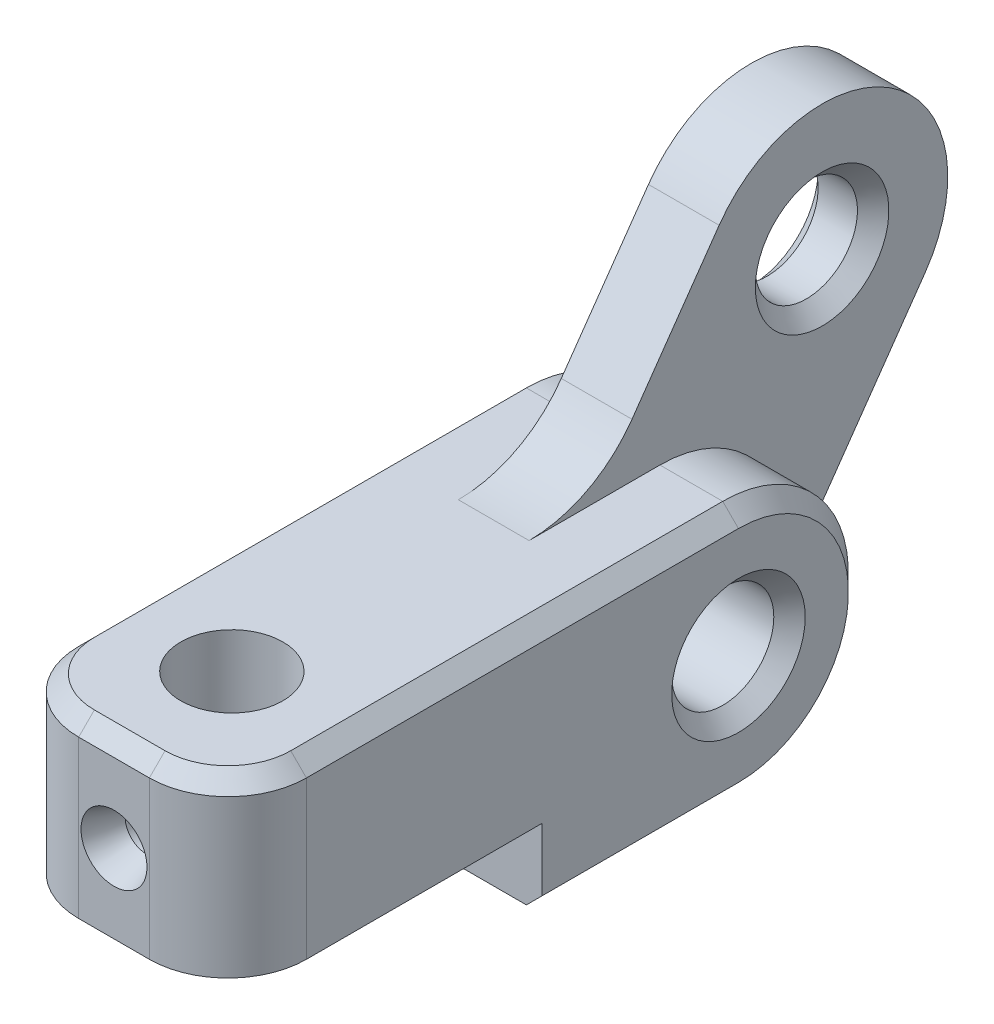
ISO-10303-21;
HEADER;
FILE_DESCRIPTION(('STEP AP214'),'2;1');
FILE_NAME('part.step','',(''),(''),'','','');
FILE_SCHEMA(('AUTOMOTIVE_DESIGN { 1 0 10303 214 1 1 1 1 }'));
ENDSEC;
DATA;
#1=APPLICATION_CONTEXT('core data for automotive mechanical design processes');
#2=APPLICATION_PROTOCOL_DEFINITION('international standard','automotive_design',2000,#1);
#3=PRODUCT_CONTEXT('',#1,'mechanical');
#4=PRODUCT('Part','Part','',(#3));
#5=PRODUCT_RELATED_PRODUCT_CATEGORY('part','',(#4));
#6=PRODUCT_DEFINITION_FORMATION('','',#4);
#7=PRODUCT_DEFINITION_CONTEXT('part definition',#1,'design');
#8=PRODUCT_DEFINITION('design','',#6,#7);
#9=PRODUCT_DEFINITION_SHAPE('','',#8);
#10=(LENGTH_UNIT() NAMED_UNIT(*) SI_UNIT(.MILLI.,.METRE.));
#11=(NAMED_UNIT(*) PLANE_ANGLE_UNIT() SI_UNIT($,.RADIAN.));
#12=(NAMED_UNIT(*) SI_UNIT($,.STERADIAN.) SOLID_ANGLE_UNIT());
#13=UNCERTAINTY_MEASURE_WITH_UNIT(LENGTH_MEASURE(1.E-05),#10,'distance_accuracy_value','');
#14=(GEOMETRIC_REPRESENTATION_CONTEXT(3) GLOBAL_UNCERTAINTY_ASSIGNED_CONTEXT((#13)) GLOBAL_UNIT_ASSIGNED_CONTEXT((#10,
#11,#12)) REPRESENTATION_CONTEXT('',''));
#15=CARTESIAN_POINT('',(0.,0.,0.));
#16=DIRECTION('',(0.,0.,1.));
#17=DIRECTION('',(1.,0.,0.));
#18=AXIS2_PLACEMENT_3D('',#15,#16,#17);
#19=CARTESIAN_POINT('',(-2.25,14.7447367972018,-10.3243758543189));
#20=DIRECTION('',(-1.,0.,0.));
#21=DIRECTION('',(0.,0.,1.));
#22=AXIS2_PLACEMENT_3D('',#19,#20,#21);
#23=PLANE('',#22);
#24=CARTESIAN_POINT('',(-2.25,14.7447367972018,-10.3243758543189));
#25=DIRECTION('',(-1.,0.,0.));
#26=DIRECTION('',(0.,0.,1.));
#27=AXIS2_PLACEMENT_3D('',#24,#25,#26);
#28=CIRCLE('',#27,4.25000000000001);
#29=CARTESIAN_POINT('',(-2.25,14.7447367972018,-6.07437585431889));
#30=VERTEX_POINT('',#29);
#31=EDGE_CURVE('E391',#30,#30,#28,.F.);
#32=ORIENTED_EDGE('',*,*,#31,.T.);
#33=EDGE_LOOP('',(#32));
#34=FACE_BOUND('',#33,.T.);
#35=DIRECTION('',(0.,0.819152044288989,-0.57357643635105));
#36=VECTOR('',#35,1.);
#37=CARTESIAN_POINT('',(-2.25,-4.58861149080837,-6.55321635431193));
#38=LINE('',#37,#36);
#39=CARTESIAN_POINT('',(-2.25,-4.5886114908084,-6.55321635431191));
#40=VERTEX_POINT('',#39);
#41=CARTESIAN_POINT('',(-2.25,10.1561253063934,-16.8775922086308));
#42=VERTEX_POINT('',#41);
#43=EDGE_CURVE('E252',#40,#42,#38,.T.);
#44=ORIENTED_EDGE('',*,*,#43,.F.);
#45=CARTESIAN_POINT('',(-2.25,0.,0.));
#46=DIRECTION('',(1.,0.,0.));
#47=DIRECTION('',(0.,0.,-1.));
#48=AXIS2_PLACEMENT_3D('',#45,#46,#47);
#49=CIRCLE('',#48,8.);
#50=CARTESIAN_POINT('',(-2.25,8.,0.));
#51=VERTEX_POINT('',#50);
#52=EDGE_CURVE('E222',#40,#51,#49,.T.);
#53=ORIENTED_EDGE('',*,*,#52,.T.);
#54=DIRECTION('',(0.,0.,1.));
#55=VECTOR('',#54,1.);
#56=CARTESIAN_POINT('',(-2.25,8.,32.5));
#57=LINE('',#56,#55);
#58=CARTESIAN_POINT('',(-2.25,8.,8.32907280882793));
#59=VERTEX_POINT('',#58);
#60=EDGE_CURVE('E214',#51,#59,#57,.T.);
#61=ORIENTED_EDGE('',*,*,#60,.T.);
#62=CARTESIAN_POINT('',(-2.25,16.,8.32907280882789));
#63=DIRECTION('',(-1.,0.,0.));
#64=DIRECTION('',(0.,0.,1.));
#65=AXIS2_PLACEMENT_3D('',#62,#63,#64);
#66=CIRCLE('',#65,8.);
#67=CARTESIAN_POINT('',(-2.25,11.4113885091916,1.77585645451596));
#68=VERTEX_POINT('',#67);
#69=EDGE_CURVE('E268',#68,#59,#66,.T.);
#70=ORIENTED_EDGE('',*,*,#69,.F.);
#71=DIRECTION('',(0.,-0.819152044288989,0.57357643635105));
#72=VECTOR('',#71,1.);
#73=CARTESIAN_POINT('',(-2.25,11.4113885091916,1.77585645451596));
#74=LINE('',#73,#72);
#75=CARTESIAN_POINT('',(-2.25,19.3333482880102,-3.77115950000699));
#76=VERTEX_POINT('',#75);
#77=EDGE_CURVE('E265',#76,#68,#74,.T.);
#78=ORIENTED_EDGE('',*,*,#77,.F.);
#79=CARTESIAN_POINT('',(-2.25,14.7447367972018,-10.3243758543189));
#80=DIRECTION('',(1.,0.,0.));
#81=DIRECTION('',(0.,0.,1.));
#82=AXIS2_PLACEMENT_3D('',#79,#80,#81);
#83=CIRCLE('',#82,8.);
#84=EDGE_CURVE('E246',#42,#76,#83,.T.);
#85=ORIENTED_EDGE('',*,*,#84,.F.);
#86=EDGE_LOOP('',(#44,#53,#61,#70,#78,#85));
#87=FACE_BOUND('',#86,.T.);
#88=ADVANCED_FACE('F48',(#34,#87),#23,.T.);
#89=CARTESIAN_POINT('',(2.25,14.7447367972018,-10.3243758543189));
#90=DIRECTION('',(-1.,0.,0.));
#91=DIRECTION('',(0.,0.,1.));
#92=AXIS2_PLACEMENT_3D('',#89,#90,#91);
#93=PLANE('',#92);
#94=CARTESIAN_POINT('',(2.25,14.7447367972018,-10.3243758543189));
#95=DIRECTION('',(-1.,0.,0.));
#96=DIRECTION('',(0.,0.,1.));
#97=AXIS2_PLACEMENT_3D('',#94,#95,#96);
#98=CIRCLE('',#97,4.25000000000002);
#99=CARTESIAN_POINT('',(2.25,14.7447367972018,-6.07437585431888));
#100=VERTEX_POINT('',#99);
#101=EDGE_CURVE('E403',#100,#100,#98,.T.);
#102=ORIENTED_EDGE('',*,*,#101,.T.);
#103=EDGE_LOOP('',(#102));
#104=FACE_BOUND('',#103,.T.);
#105=DIRECTION('',(0.,0.,1.));
#106=VECTOR('',#105,1.);
#107=CARTESIAN_POINT('',(2.25,8.,32.5));
#108=LINE('',#107,#106);
#109=CARTESIAN_POINT('',(2.25,8.,0.));
#110=VERTEX_POINT('',#109);
#111=CARTESIAN_POINT('',(2.25,8.,8.32907280882793));
#112=VERTEX_POINT('',#111);
#113=EDGE_CURVE('E230',#110,#112,#108,.T.);
#114=ORIENTED_EDGE('',*,*,#113,.F.);
#115=CARTESIAN_POINT('',(2.25,0.,0.));
#116=DIRECTION('',(1.,0.,0.));
#117=DIRECTION('',(0.,0.,-1.));
#118=AXIS2_PLACEMENT_3D('',#115,#116,#117);
#119=CIRCLE('',#118,8.);
#120=CARTESIAN_POINT('',(2.25,-4.58861149080837,-6.55321635431193));
#121=VERTEX_POINT('',#120);
#122=EDGE_CURVE('E227',#121,#110,#119,.T.);
#123=ORIENTED_EDGE('',*,*,#122,.F.);
#124=DIRECTION('',(0.,0.819152044288989,-0.57357643635105));
#125=VECTOR('',#124,1.);
#126=CARTESIAN_POINT('',(2.25,-4.58861149080837,-6.55321635431193));
#127=LINE('',#126,#125);
#128=CARTESIAN_POINT('',(2.25,10.1561253063934,-16.8775922086308));
#129=VERTEX_POINT('',#128);
#130=EDGE_CURVE('E258',#121,#129,#127,.T.);
#131=ORIENTED_EDGE('',*,*,#130,.T.);
#132=CARTESIAN_POINT('',(2.25,14.7447367972018,-10.3243758543189));
#133=DIRECTION('',(1.,0.,0.));
#134=DIRECTION('',(0.,0.,1.));
#135=AXIS2_PLACEMENT_3D('',#132,#133,#134);
#136=CIRCLE('',#135,8.);
#137=CARTESIAN_POINT('',(2.25,19.3333482880102,-3.77115950000699));
#138=VERTEX_POINT('',#137);
#139=EDGE_CURVE('E247',#129,#138,#136,.T.);
#140=ORIENTED_EDGE('',*,*,#139,.T.);
#141=DIRECTION('',(0.,-0.819152044288989,0.57357643635105));
#142=VECTOR('',#141,1.);
#143=CARTESIAN_POINT('',(2.25,11.4113885091916,1.77585645451596));
#144=LINE('',#143,#142);
#145=CARTESIAN_POINT('',(2.25,11.4113885091916,1.77585645451596));
#146=VERTEX_POINT('',#145);
#147=EDGE_CURVE('E251',#138,#146,#144,.T.);
#148=ORIENTED_EDGE('',*,*,#147,.T.);
#149=CARTESIAN_POINT('',(2.25,16.,8.32907280882789));
#150=DIRECTION('',(-1.,0.,0.));
#151=DIRECTION('',(0.,0.,1.));
#152=AXIS2_PLACEMENT_3D('',#149,#150,#151);
#153=CIRCLE('',#152,8.);
#154=EDGE_CURVE('E255',#146,#112,#153,.T.);
#155=ORIENTED_EDGE('',*,*,#154,.T.);
#156=EDGE_LOOP('',(#114,#123,#131,#140,#148,#155));
#157=FACE_BOUND('',#156,.T.);
#158=ADVANCED_FACE('F463',(#104,#157),#93,.F.);
#159=CARTESIAN_POINT('',(2.25,14.7447367972018,-10.3243758543189));
#160=DIRECTION('',(-1.,0.,0.));
#161=DIRECTION('',(0.,0.,1.));
#162=AXIS2_PLACEMENT_3D('',#159,#160,#161);
#163=CYLINDRICAL_SURFACE('',#162,8.);
#164=ORIENTED_EDGE('',*,*,#84,.T.);
#165=DIRECTION('',(-1.,0.,0.));
#166=VECTOR('',#165,1.);
#167=CARTESIAN_POINT('',(2.25,19.3333482880102,-3.77115950000699));
#168=LINE('',#167,#166);
#169=EDGE_CURVE('E240',#138,#76,#168,.T.);
#170=ORIENTED_EDGE('',*,*,#169,.F.);
#171=ORIENTED_EDGE('',*,*,#139,.F.);
#172=DIRECTION('',(-1.,0.,0.));
#173=VECTOR('',#172,1.);
#174=CARTESIAN_POINT('',(2.25,10.1561253063934,-16.8775922086308));
#175=LINE('',#174,#173);
#176=EDGE_CURVE('E261',#129,#42,#175,.T.);
#177=ORIENTED_EDGE('',*,*,#176,.T.);
#178=EDGE_LOOP('',(#164,#170,#171,#177));
#179=FACE_BOUND('',#178,.T.);
#180=ADVANCED_FACE('F470',(#179),#163,.T.);
#181=CARTESIAN_POINT('',(2.25,11.4113885091916,1.77585645451596));
#182=DIRECTION('',(0.,-0.57357643635105,-0.819152044288989));
#183=DIRECTION('',(0.,0.819152044288989,-0.57357643635105));
#184=AXIS2_PLACEMENT_3D('',#181,#182,#183);
#185=PLANE('',#184);
#186=ORIENTED_EDGE('',*,*,#77,.T.);
#187=DIRECTION('',(-1.,0.,0.));
#188=VECTOR('',#187,1.);
#189=CARTESIAN_POINT('',(2.25,11.4113885091916,1.77585645451596));
#190=LINE('',#189,#188);
#191=EDGE_CURVE('E294',#146,#68,#190,.T.);
#192=ORIENTED_EDGE('',*,*,#191,.F.);
#193=ORIENTED_EDGE('',*,*,#147,.F.);
#194=ORIENTED_EDGE('',*,*,#169,.T.);
#195=EDGE_LOOP('',(#186,#192,#193,#194));
#196=FACE_BOUND('',#195,.T.);
#197=ADVANCED_FACE('F505',(#196),#185,.F.);
#198=CARTESIAN_POINT('',(2.25,16.,8.32907280882789));
#199=DIRECTION('',(-1.,0.,0.));
#200=DIRECTION('',(0.,0.,1.));
#201=AXIS2_PLACEMENT_3D('',#198,#199,#200);
#202=CYLINDRICAL_SURFACE('',#201,8.);
#203=ORIENTED_EDGE('',*,*,#69,.T.);
#204=DIRECTION('',(-1.,0.,0.));
#205=VECTOR('',#204,1.);
#206=CARTESIAN_POINT('',(2.25,8.,8.32907280882793));
#207=LINE('',#206,#205);
#208=EDGE_CURVE('E290',#112,#59,#207,.T.);
#209=ORIENTED_EDGE('',*,*,#208,.F.);
#210=ORIENTED_EDGE('',*,*,#154,.F.);
#211=ORIENTED_EDGE('',*,*,#191,.T.);
#212=EDGE_LOOP('',(#203,#209,#210,#211));
#213=FACE_BOUND('',#212,.T.);
#214=ADVANCED_FACE('F501',(#213),#202,.F.);
#215=CARTESIAN_POINT('',(2.25,8.,25.));
#216=DIRECTION('',(0.,-1.,0.));
#217=DIRECTION('',(0.,0.,-1.));
#218=AXIS2_PLACEMENT_3D('',#215,#216,#217);
#219=PLANE('',#218);
#220=CARTESIAN_POINT('',(0.,8.,25.));
#221=DIRECTION('',(0.,-1.,0.));
#222=DIRECTION('',(0.,0.,-1.));
#223=AXIS2_PLACEMENT_3D('',#220,#221,#222);
#224=CIRCLE('',#223,3.25);
#225=CARTESIAN_POINT('',(0.,8.,21.75));
#226=VERTEX_POINT('',#225);
#227=EDGE_CURVE('E217',#226,#226,#224,.T.);
#228=ORIENTED_EDGE('',*,*,#227,.T.);
#229=EDGE_LOOP('',(#228));
#230=FACE_BOUND('',#229,.T.);
#231=DIRECTION('',(1.,0.,0.));
#232=VECTOR('',#231,1.);
#233=CARTESIAN_POINT('',(-7.25,8.,0.));
#234=LINE('',#233,#232);
#235=CARTESIAN_POINT('',(-6.24999999999999,8.,0.));
#236=VERTEX_POINT('',#235);
#237=EDGE_CURVE('E197',#236,#51,#234,.T.);
#238=ORIENTED_EDGE('',*,*,#237,.F.);
#239=DIRECTION('',(0.,0.,1.));
#240=VECTOR('',#239,1.);
#241=CARTESIAN_POINT('',(-6.24999999999999,8.,27.5));
#242=LINE('',#241,#240);
#243=CARTESIAN_POINT('',(-6.24999999999999,8.,27.5));
#244=VERTEX_POINT('',#243);
#245=EDGE_CURVE('E381',#236,#244,#242,.T.);
#246=ORIENTED_EDGE('',*,*,#245,.T.);
#247=CARTESIAN_POINT('',(-2.25,8.,27.5));
#248=DIRECTION('',(0.,-1.,0.));
#249=DIRECTION('',(0.,0.,-1.));
#250=AXIS2_PLACEMENT_3D('',#247,#248,#249);
#251=CIRCLE('',#250,3.99999999999999);
#252=CARTESIAN_POINT('',(-2.25,8.,31.5));
#253=VERTEX_POINT('',#252);
#254=EDGE_CURVE('E378',#244,#253,#251,.F.);
#255=ORIENTED_EDGE('',*,*,#254,.T.);
#256=DIRECTION('',(1.,0.,0.));
#257=VECTOR('',#256,1.);
#258=CARTESIAN_POINT('',(2.25,8.,31.5));
#259=LINE('',#258,#257);
#260=CARTESIAN_POINT('',(2.25,8.,31.5));
#261=VERTEX_POINT('',#260);
#262=EDGE_CURVE('E375',#253,#261,#259,.T.);
#263=ORIENTED_EDGE('',*,*,#262,.T.);
#264=CARTESIAN_POINT('',(2.25,8.,27.5));
#265=DIRECTION('',(0.,-1.,0.));
#266=DIRECTION('',(0.,0.,-1.));
#267=AXIS2_PLACEMENT_3D('',#264,#265,#266);
#268=CIRCLE('',#267,3.99999999999999);
#269=CARTESIAN_POINT('',(6.24999999999999,8.,27.5));
#270=VERTEX_POINT('',#269);
#271=EDGE_CURVE('E372',#261,#270,#268,.F.);
#272=ORIENTED_EDGE('',*,*,#271,.T.);
#273=DIRECTION('',(0.,0.,-1.));
#274=VECTOR('',#273,1.);
#275=CARTESIAN_POINT('',(6.24999999999999,8.00000000000001,0.));
#276=LINE('',#275,#274);
#277=CARTESIAN_POINT('',(6.24999999999999,8.,0.));
#278=VERTEX_POINT('',#277);
#279=EDGE_CURVE('E369',#270,#278,#276,.T.);
#280=ORIENTED_EDGE('',*,*,#279,.T.);
#281=DIRECTION('',(-1.,0.,0.));
#282=VECTOR('',#281,1.);
#283=CARTESIAN_POINT('',(7.25,8.,0.));
#284=LINE('',#283,#282);
#285=EDGE_CURVE('E236',#278,#110,#284,.T.);
#286=ORIENTED_EDGE('',*,*,#285,.T.);
#287=ORIENTED_EDGE('',*,*,#113,.T.);
#288=ORIENTED_EDGE('',*,*,#208,.T.);
#289=ORIENTED_EDGE('',*,*,#60,.F.);
#290=EDGE_LOOP('',(#238,#246,#255,#263,#272,#280,#286,#287,#288,#289));
#291=FACE_BOUND('',#290,.T.);
#292=ADVANCED_FACE('F497',(#230,#291),#219,.F.);
#293=CARTESIAN_POINT('',(2.25,8.,32.5));
#294=DIRECTION('',(0.,0.,-1.));
#295=DIRECTION('',(-1.,0.,0.));
#296=AXIS2_PLACEMENT_3D('',#293,#294,#295);
#297=PLANE('',#296);
#298=CARTESIAN_POINT('',(0.,2.,32.5));
#299=DIRECTION('',(0.,0.,-1.));
#300=DIRECTION('',(-1.,0.,0.));
#301=AXIS2_PLACEMENT_3D('',#298,#299,#300);
#302=CIRCLE('',#301,2.10000000000007);
#303=CARTESIAN_POINT('',(-2.10000000000007,2.,32.5));
#304=VERTEX_POINT('',#303);
#305=EDGE_CURVE('E443',#304,#304,#302,.T.);
#306=ORIENTED_EDGE('',*,*,#305,.T.);
#307=EDGE_LOOP('',(#306));
#308=FACE_BOUND('',#307,.T.);
#309=DIRECTION('',(0.,-1.,0.));
#310=VECTOR('',#309,1.);
#311=CARTESIAN_POINT('',(2.25,8.,32.5));
#312=LINE('',#311,#310);
#313=CARTESIAN_POINT('',(2.25,-3.,32.5));
#314=VERTEX_POINT('',#313);
#315=CARTESIAN_POINT('',(2.25,6.99999999999999,32.5));
#316=VERTEX_POINT('',#315);
#317=EDGE_CURVE('E226',#314,#316,#312,.F.);
#318=ORIENTED_EDGE('',*,*,#317,.T.);
#319=DIRECTION('',(-1.,0.,0.));
#320=VECTOR('',#319,1.);
#321=CARTESIAN_POINT('',(2.25,6.99999999999999,32.5));
#322=LINE('',#321,#320);
#323=CARTESIAN_POINT('',(-2.25,6.99999999999999,32.5));
#324=VERTEX_POINT('',#323);
#325=EDGE_CURVE('E72',#316,#324,#322,.T.);
#326=ORIENTED_EDGE('',*,*,#325,.T.);
#327=DIRECTION('',(0.,-1.,0.));
#328=VECTOR('',#327,1.);
#329=CARTESIAN_POINT('',(-2.25,-3.,32.5));
#330=LINE('',#329,#328);
#331=CARTESIAN_POINT('',(-2.25,-3.,32.5));
#332=VERTEX_POINT('',#331);
#333=EDGE_CURVE('E303',#324,#332,#330,.T.);
#334=ORIENTED_EDGE('',*,*,#333,.T.);
#335=DIRECTION('',(-1.,0.,0.));
#336=VECTOR('',#335,1.);
#337=CARTESIAN_POINT('',(2.25,-3.,32.5));
#338=LINE('',#337,#336);
#339=EDGE_CURVE('E207',#314,#332,#338,.T.);
#340=ORIENTED_EDGE('',*,*,#339,.F.);
#341=EDGE_LOOP('',(#318,#326,#334,#340));
#342=FACE_BOUND('',#341,.T.);
#343=ADVANCED_FACE('F493',(#308,#342),#297,.F.);
#344=CARTESIAN_POINT('',(2.25,-3.,32.5));
#345=DIRECTION('',(0.,1.,0.));
#346=DIRECTION('',(0.,0.,1.));
#347=AXIS2_PLACEMENT_3D('',#344,#345,#346);
#348=PLANE('',#347);
#349=CARTESIAN_POINT('',(0.,-3.,25.));
#350=DIRECTION('',(0.,1.,0.));
#351=DIRECTION('',(0.,0.,1.));
#352=AXIS2_PLACEMENT_3D('',#349,#350,#351);
#353=CIRCLE('',#352,4.25000000000002);
#354=CARTESIAN_POINT('',(0.,-3.,29.25));
#355=VERTEX_POINT('',#354);
#356=EDGE_CURVE('E11',#355,#355,#353,.T.);
#357=ORIENTED_EDGE('',*,*,#356,.T.);
#358=EDGE_LOOP('',(#357));
#359=FACE_BOUND('',#358,.T.);
#360=ORIENTED_EDGE('',*,*,#339,.T.);
#361=CARTESIAN_POINT('',(-2.25,-3.,27.5));
#362=DIRECTION('',(0.,1.,0.));
#363=DIRECTION('',(0.,0.,1.));
#364=AXIS2_PLACEMENT_3D('',#361,#362,#363);
#365=CIRCLE('',#364,5.);
#366=CARTESIAN_POINT('',(-7.25,-3.,27.5));
#367=VERTEX_POINT('',#366);
#368=EDGE_CURVE('E191',#332,#367,#365,.F.);
#369=ORIENTED_EDGE('',*,*,#368,.T.);
#370=DIRECTION('',(0.,0.,-1.));
#371=VECTOR('',#370,1.);
#372=CARTESIAN_POINT('',(-7.25,-3.,32.5));
#373=LINE('',#372,#371);
#374=CARTESIAN_POINT('',(-7.25,-3.,12.5));
#375=VERTEX_POINT('',#374);
#376=EDGE_CURVE('E183',#367,#375,#373,.T.);
#377=ORIENTED_EDGE('',*,*,#376,.T.);
#378=DIRECTION('',(-1.,0.,0.));
#379=VECTOR('',#378,1.);
#380=CARTESIAN_POINT('',(2.25,-3.,12.5));
#381=LINE('',#380,#379);
#382=CARTESIAN_POINT('',(7.25,-3.,12.5));
#383=VERTEX_POINT('',#382);
#384=EDGE_CURVE('E188',#383,#375,#381,.T.);
#385=ORIENTED_EDGE('',*,*,#384,.F.);
#386=DIRECTION('',(0.,0.,-1.));
#387=VECTOR('',#386,1.);
#388=CARTESIAN_POINT('',(7.25,-3.,32.5));
#389=LINE('',#388,#387);
#390=CARTESIAN_POINT('',(7.25,-3.,27.5));
#391=VERTEX_POINT('',#390);
#392=EDGE_CURVE('E231',#391,#383,#389,.T.);
#393=ORIENTED_EDGE('',*,*,#392,.F.);
#394=CARTESIAN_POINT('',(2.25,-3.,27.5));
#395=DIRECTION('',(0.,1.,0.));
#396=DIRECTION('',(0.,0.,1.));
#397=AXIS2_PLACEMENT_3D('',#394,#395,#396);
#398=CIRCLE('',#397,5.);
#399=EDGE_CURVE('E306',#391,#314,#398,.F.);
#400=ORIENTED_EDGE('',*,*,#399,.T.);
#401=EDGE_LOOP('',(#360,#369,#377,#385,#393,#400));
#402=FACE_BOUND('',#401,.T.);
#403=ADVANCED_FACE('F186',(#359,#402),#348,.F.);
#404=CARTESIAN_POINT('',(2.25,-3.,12.5));
#405=DIRECTION('',(0.,0.,-1.));
#406=DIRECTION('',(-1.,0.,0.));
#407=AXIS2_PLACEMENT_3D('',#404,#405,#406);
#408=PLANE('',#407);
#409=DIRECTION('',(0.,-1.,0.));
#410=VECTOR('',#409,1.);
#411=CARTESIAN_POINT('',(-7.25,-3.,12.5));
#412=LINE('',#411,#410);
#413=CARTESIAN_POINT('',(-7.25,-6.99999999999999,12.5));
#414=VERTEX_POINT('',#413);
#415=EDGE_CURVE('E198',#375,#414,#412,.T.);
#416=ORIENTED_EDGE('',*,*,#415,.T.);
#417=DIRECTION('',(0.707106781186548,-0.707106781186548,0.));
#418=VECTOR('',#417,1.);
#419=CARTESIAN_POINT('',(-6.24999999999999,-8.,12.5));
#420=LINE('',#419,#418);
#421=CARTESIAN_POINT('',(-6.24999999999999,-8.,12.5));
#422=VERTEX_POINT('',#421);
#423=EDGE_CURVE('E366',#414,#422,#420,.T.);
#424=ORIENTED_EDGE('',*,*,#423,.T.);
#425=DIRECTION('',(-1.,0.,0.));
#426=VECTOR('',#425,1.);
#427=CARTESIAN_POINT('',(2.25,-8.,12.5));
#428=LINE('',#427,#426);
#429=CARTESIAN_POINT('',(6.24999999999999,-8.,12.5));
#430=VERTEX_POINT('',#429);
#431=EDGE_CURVE('E208',#430,#422,#428,.T.);
#432=ORIENTED_EDGE('',*,*,#431,.F.);
#433=DIRECTION('',(0.707106781186548,0.707106781186548,0.));
#434=VECTOR('',#433,1.);
#435=CARTESIAN_POINT('',(7.25,-6.99999999999999,12.5));
#436=LINE('',#435,#434);
#437=CARTESIAN_POINT('',(7.25,-6.99999999999999,12.5));
#438=VERTEX_POINT('',#437);
#439=EDGE_CURVE('E363',#430,#438,#436,.T.);
#440=ORIENTED_EDGE('',*,*,#439,.T.);
#441=DIRECTION('',(0.,-1.,0.));
#442=VECTOR('',#441,1.);
#443=CARTESIAN_POINT('',(7.25,-3.,12.5));
#444=LINE('',#443,#442);
#445=EDGE_CURVE('E205',#383,#438,#444,.T.);
#446=ORIENTED_EDGE('',*,*,#445,.F.);
#447=ORIENTED_EDGE('',*,*,#384,.T.);
#448=EDGE_LOOP('',(#416,#424,#432,#440,#446,#447));
#449=FACE_BOUND('',#448,.T.);
#450=ADVANCED_FACE('F202',(#449),#408,.F.);
#451=CARTESIAN_POINT('',(2.25,-8.,12.5));
#452=DIRECTION('',(0.,1.,0.));
#453=DIRECTION('',(0.,0.,1.));
#454=AXIS2_PLACEMENT_3D('',#451,#452,#453);
#455=PLANE('',#454);
#456=ORIENTED_EDGE('',*,*,#431,.T.);
#457=DIRECTION('',(0.,0.,-1.));
#458=VECTOR('',#457,1.);
#459=CARTESIAN_POINT('',(-6.24999999999999,-8.,0.));
#460=LINE('',#459,#458);
#461=CARTESIAN_POINT('',(-6.24999999999999,-8.,0.));
#462=VERTEX_POINT('',#461);
#463=EDGE_CURVE('E360',#422,#462,#460,.T.);
#464=ORIENTED_EDGE('',*,*,#463,.T.);
#465=DIRECTION('',(-1.,0.,0.));
#466=VECTOR('',#465,1.);
#467=CARTESIAN_POINT('',(2.25,-8.,0.));
#468=LINE('',#467,#466);
#469=CARTESIAN_POINT('',(6.24999999999999,-8.,0.));
#470=VERTEX_POINT('',#469);
#471=EDGE_CURVE('E281',#470,#462,#468,.T.);
#472=ORIENTED_EDGE('',*,*,#471,.F.);
#473=DIRECTION('',(0.,0.,1.));
#474=VECTOR('',#473,1.);
#475=CARTESIAN_POINT('',(6.24999999999999,-8.,12.5));
#476=LINE('',#475,#474);
#477=EDGE_CURVE('E357',#470,#430,#476,.T.);
#478=ORIENTED_EDGE('',*,*,#477,.T.);
#479=EDGE_LOOP('',(#456,#464,#472,#478));
#480=FACE_BOUND('',#479,.T.);
#481=ADVANCED_FACE('F484',(#480),#455,.F.);
#482=CARTESIAN_POINT('',(2.25,0.,0.));
#483=DIRECTION('',(-1.,0.,0.));
#484=DIRECTION('',(0.,0.,1.));
#485=AXIS2_PLACEMENT_3D('',#482,#483,#484);
#486=CYLINDRICAL_SURFACE('',#485,8.);
#487=ORIENTED_EDGE('',*,*,#471,.T.);
#488=CARTESIAN_POINT('',(-6.24999999999999,0.,0.));
#489=DIRECTION('',(-1.,0.,0.));
#490=DIRECTION('',(0.,0.,1.));
#491=AXIS2_PLACEMENT_3D('',#488,#489,#490);
#492=CIRCLE('',#491,8.);
#493=EDGE_CURVE('E353',#462,#236,#492,.F.);
#494=ORIENTED_EDGE('',*,*,#493,.T.);
#495=ORIENTED_EDGE('',*,*,#237,.T.);
#496=ORIENTED_EDGE('',*,*,#52,.F.);
#497=DIRECTION('',(-1.,0.,0.));
#498=VECTOR('',#497,1.);
#499=CARTESIAN_POINT('',(2.25,-4.58861149080837,-6.55321635431193));
#500=LINE('',#499,#498);
#501=EDGE_CURVE('E277',#121,#40,#500,.T.);
#502=ORIENTED_EDGE('',*,*,#501,.F.);
#503=ORIENTED_EDGE('',*,*,#122,.T.);
#504=ORIENTED_EDGE('',*,*,#285,.F.);
#505=CARTESIAN_POINT('',(6.24999999999999,0.,0.));
#506=DIRECTION('',(1.,0.,0.));
#507=DIRECTION('',(0.,0.,-1.));
#508=AXIS2_PLACEMENT_3D('',#505,#506,#507);
#509=CIRCLE('',#508,8.);
#510=EDGE_CURVE('E350',#278,#470,#509,.F.);
#511=ORIENTED_EDGE('',*,*,#510,.T.);
#512=EDGE_LOOP('',(#487,#494,#495,#496,#502,#503,#504,#511));
#513=FACE_BOUND('',#512,.T.);
#514=ADVANCED_FACE('F480',(#513),#486,.T.);
#515=CARTESIAN_POINT('',(2.25,-4.58861149080837,-6.55321635431193));
#516=DIRECTION('',(0.,0.57357643635105,0.819152044288989));
#517=DIRECTION('',(0.,-0.819152044288989,0.57357643635105));
#518=AXIS2_PLACEMENT_3D('',#515,#516,#517);
#519=PLANE('',#518);
#520=ORIENTED_EDGE('',*,*,#43,.T.);
#521=ORIENTED_EDGE('',*,*,#176,.F.);
#522=ORIENTED_EDGE('',*,*,#130,.F.);
#523=ORIENTED_EDGE('',*,*,#501,.T.);
#524=EDGE_LOOP('',(#520,#521,#522,#523));
#525=FACE_BOUND('',#524,.T.);
#526=ADVANCED_FACE('F476',(#525),#519,.F.);
#527=CARTESIAN_POINT('',(2.25,0.,0.));
#528=DIRECTION('',(-1.,0.,0.));
#529=DIRECTION('',(0.,0.,1.));
#530=AXIS2_PLACEMENT_3D('',#527,#528,#529);
#531=CYLINDRICAL_SURFACE('',#530,3.25);
#532=CARTESIAN_POINT('',(-6.25,0.,0.));
#533=DIRECTION('',(-1.,0.,0.));
#534=DIRECTION('',(0.,0.,1.));
#535=AXIS2_PLACEMENT_3D('',#532,#533,#534);
#536=CIRCLE('',#535,3.25);
#537=CARTESIAN_POINT('',(-6.25,0.,3.25));
#538=VERTEX_POINT('',#537);
#539=EDGE_CURVE('E333',#538,#538,#536,.T.);
#540=ORIENTED_EDGE('',*,*,#539,.T.);
#541=EDGE_LOOP('',(#540));
#542=FACE_BOUND('',#541,.T.);
#543=CARTESIAN_POINT('',(6.24999999999999,0.,0.));
#544=DIRECTION('',(1.,0.,0.));
#545=DIRECTION('',(0.,0.,-1.));
#546=AXIS2_PLACEMENT_3D('',#543,#544,#545);
#547=CIRCLE('',#546,3.25);
#548=CARTESIAN_POINT('',(6.24999999999999,0.,-3.25));
#549=VERTEX_POINT('',#548);
#550=EDGE_CURVE('E329',#549,#549,#547,.T.);
#551=ORIENTED_EDGE('',*,*,#550,.T.);
#552=EDGE_LOOP('',(#551));
#553=FACE_BOUND('',#552,.T.);
#554=ADVANCED_FACE('F479',(#542,#553),#531,.F.);
#555=CARTESIAN_POINT('',(2.25,14.7447367972018,-10.3243758543189));
#556=DIRECTION('',(-1.,0.,0.));
#557=DIRECTION('',(0.,0.,1.));
#558=AXIS2_PLACEMENT_3D('',#555,#556,#557);
#559=CYLINDRICAL_SURFACE('',#558,3.25);
#560=CARTESIAN_POINT('',(-1.24999999999999,14.7447367972018,-10.3243758543189));
#561=DIRECTION('',(-1.,0.,0.));
#562=DIRECTION('',(0.,0.,1.));
#563=AXIS2_PLACEMENT_3D('',#560,#561,#562);
#564=CIRCLE('',#563,3.25);
#565=CARTESIAN_POINT('',(-1.24999999999999,14.7447367972018,-7.0743758543189));
#566=VERTEX_POINT('',#565);
#567=EDGE_CURVE('E399',#566,#566,#564,.T.);
#568=ORIENTED_EDGE('',*,*,#567,.T.);
#569=EDGE_LOOP('',(#568));
#570=FACE_BOUND('',#569,.T.);
#571=CARTESIAN_POINT('',(1.24999999999999,14.7447367972018,-10.3243758543189));
#572=DIRECTION('',(-1.,0.,0.));
#573=DIRECTION('',(0.,0.,1.));
#574=AXIS2_PLACEMENT_3D('',#571,#572,#573);
#575=CIRCLE('',#574,3.25);
#576=CARTESIAN_POINT('',(1.24999999999999,14.7447367972018,-7.0743758543189));
#577=VERTEX_POINT('',#576);
#578=EDGE_CURVE('E395',#577,#577,#575,.F.);
#579=ORIENTED_EDGE('',*,*,#578,.T.);
#580=EDGE_LOOP('',(#579));
#581=FACE_BOUND('',#580,.T.);
#582=ADVANCED_FACE('F624',(#570,#581),#559,.F.);
#583=CARTESIAN_POINT('',(7.25,0.,0.));
#584=DIRECTION('',(1.,0.,0.));
#585=DIRECTION('',(0.,0.,-1.));
#586=AXIS2_PLACEMENT_3D('',#583,#584,#585);
#587=PLANE('',#586);
#588=CARTESIAN_POINT('',(7.25,0.,0.));
#589=DIRECTION('',(1.,0.,0.));
#590=DIRECTION('',(0.,0.,-1.));
#591=AXIS2_PLACEMENT_3D('',#588,#589,#590);
#592=CIRCLE('',#591,4.25000000000001);
#593=CARTESIAN_POINT('',(7.25,0.,-4.25000000000001));
#594=VERTEX_POINT('',#593);
#595=EDGE_CURVE('E346',#594,#594,#592,.F.);
#596=ORIENTED_EDGE('',*,*,#595,.T.);
#597=EDGE_LOOP('',(#596));
#598=FACE_BOUND('',#597,.T.);
#599=ORIENTED_EDGE('',*,*,#445,.T.);
#600=DIRECTION('',(0.,0.,-1.));
#601=VECTOR('',#600,1.);
#602=CARTESIAN_POINT('',(7.25,-6.99999999999999,0.));
#603=LINE('',#602,#601);
#604=CARTESIAN_POINT('',(7.25,-6.99999999999999,0.));
#605=VERTEX_POINT('',#604);
#606=EDGE_CURVE('E343',#438,#605,#603,.T.);
#607=ORIENTED_EDGE('',*,*,#606,.T.);
#608=CARTESIAN_POINT('',(7.25,0.,0.));
#609=DIRECTION('',(1.,0.,0.));
#610=DIRECTION('',(0.,0.,-1.));
#611=AXIS2_PLACEMENT_3D('',#608,#609,#610);
#612=CIRCLE('',#611,6.99999999999999);
#613=CARTESIAN_POINT('',(7.25,6.99999999999999,0.));
#614=VERTEX_POINT('',#613);
#615=EDGE_CURVE('E337',#605,#614,#612,.T.);
#616=ORIENTED_EDGE('',*,*,#615,.T.);
#617=DIRECTION('',(0.,0.,1.));
#618=VECTOR('',#617,1.);
#619=CARTESIAN_POINT('',(7.25,6.99999999999999,27.5));
#620=LINE('',#619,#618);
#621=CARTESIAN_POINT('',(7.25,6.99999999999999,27.5));
#622=VERTEX_POINT('',#621);
#623=EDGE_CURVE('E340',#614,#622,#620,.T.);
#624=ORIENTED_EDGE('',*,*,#623,.T.);
#625=DIRECTION('',(0.,-1.,0.));
#626=VECTOR('',#625,1.);
#627=CARTESIAN_POINT('',(7.25,-3.,27.5));
#628=LINE('',#627,#626);
#629=EDGE_CURVE('E314',#622,#391,#628,.T.);
#630=ORIENTED_EDGE('',*,*,#629,.T.);
#631=ORIENTED_EDGE('',*,*,#392,.T.);
#632=EDGE_LOOP('',(#599,#607,#616,#624,#630,#631));
#633=FACE_BOUND('',#632,.T.);
#634=ADVANCED_FACE('F626',(#598,#633),#587,.T.);
#635=CARTESIAN_POINT('',(-7.25,0.,0.));
#636=DIRECTION('',(-1.,0.,0.));
#637=DIRECTION('',(0.,0.,-1.));
#638=AXIS2_PLACEMENT_3D('',#635,#636,#637);
#639=PLANE('',#638);
#640=CARTESIAN_POINT('',(-7.25,0.,0.));
#641=DIRECTION('',(-1.,0.,0.));
#642=DIRECTION('',(0.,0.,1.));
#643=AXIS2_PLACEMENT_3D('',#640,#641,#642);
#644=CIRCLE('',#643,4.25);
#645=CARTESIAN_POINT('',(-7.25,0.,4.25));
#646=VERTEX_POINT('',#645);
#647=EDGE_CURVE('E325',#646,#646,#644,.F.);
#648=ORIENTED_EDGE('',*,*,#647,.T.);
#649=EDGE_LOOP('',(#648));
#650=FACE_BOUND('',#649,.T.);
#651=CARTESIAN_POINT('',(-7.25,0.,0.));
#652=DIRECTION('',(-1.,0.,0.));
#653=DIRECTION('',(0.,0.,1.));
#654=AXIS2_PLACEMENT_3D('',#651,#652,#653);
#655=CIRCLE('',#654,6.99999999999999);
#656=CARTESIAN_POINT('',(-7.25,7.,0.));
#657=VERTEX_POINT('',#656);
#658=CARTESIAN_POINT('',(-7.25,-6.99999999999999,0.));
#659=VERTEX_POINT('',#658);
#660=EDGE_CURVE('E320',#657,#659,#655,.T.);
#661=ORIENTED_EDGE('',*,*,#660,.T.);
#662=DIRECTION('',(0.,0.,1.));
#663=VECTOR('',#662,1.);
#664=CARTESIAN_POINT('',(-7.25,-6.99999999999999,12.5));
#665=LINE('',#664,#663);
#666=EDGE_CURVE('E212',#659,#414,#665,.T.);
#667=ORIENTED_EDGE('',*,*,#666,.T.);
#668=ORIENTED_EDGE('',*,*,#415,.F.);
#669=ORIENTED_EDGE('',*,*,#376,.F.);
#670=DIRECTION('',(0.,-1.,0.));
#671=VECTOR('',#670,1.);
#672=CARTESIAN_POINT('',(-7.25,8.,27.5));
#673=LINE('',#672,#671);
#674=CARTESIAN_POINT('',(-7.25,6.99999999999999,27.5));
#675=VERTEX_POINT('',#674);
#676=EDGE_CURVE('E311',#367,#675,#673,.F.);
#677=ORIENTED_EDGE('',*,*,#676,.T.);
#678=DIRECTION('',(0.,0.,-1.));
#679=VECTOR('',#678,1.);
#680=CARTESIAN_POINT('',(-7.25,7.,0.));
#681=LINE('',#680,#679);
#682=EDGE_CURVE('E317',#675,#657,#681,.T.);
#683=ORIENTED_EDGE('',*,*,#682,.T.);
#684=EDGE_LOOP('',(#661,#667,#668,#669,#677,#683));
#685=FACE_BOUND('',#684,.T.);
#686=ADVANCED_FACE('F210',(#650,#685),#639,.T.);
#687=CARTESIAN_POINT('',(0.,22.7447367972018,25.));
#688=DIRECTION('',(0.,-1.,0.));
#689=DIRECTION('',(0.,0.,-1.));
#690=AXIS2_PLACEMENT_3D('',#687,#688,#689);
#691=CYLINDRICAL_SURFACE('',#690,3.25);
#692=CARTESIAN_POINT('',(0.,-1.99999999999997,25.));
#693=DIRECTION('',(0.,1.,0.));
#694=DIRECTION('',(0.,0.,1.));
#695=AXIS2_PLACEMENT_3D('',#692,#693,#694);
#696=CIRCLE('',#695,3.25);
#697=CARTESIAN_POINT('',(0.,-1.99999999999997,28.25));
#698=VERTEX_POINT('',#697);
#699=EDGE_CURVE('E58',#698,#698,#696,.F.);
#700=ORIENTED_EDGE('',*,*,#699,.T.);
#701=EDGE_LOOP('',(#700));
#702=FACE_BOUND('',#701,.T.);
#703=CARTESIAN_POINT('',(1.35,2.,27.9563490998189));
#704=CARTESIAN_POINT('',(1.34999208261101,1.92797172453535,27.9563567394199));
#705=CARTESIAN_POINT('',(1.34419896370929,1.85582490762838,27.9590197984011));
#706=CARTESIAN_POINT('',(1.32124951031439,1.71361201910484,27.9693344734434));
#707=CARTESIAN_POINT('',(1.30406223125097,1.64355215823794,27.9769996735667));
#708=CARTESIAN_POINT('',(1.25910809327126,1.50782661409914,27.9962873558088));
#709=CARTESIAN_POINT('',(1.23138418097222,1.44214434877494,28.0078937536769));
#710=CARTESIAN_POINT('',(1.16626970601602,1.31638239899132,28.0337331668564));
#711=CARTESIAN_POINT('',(1.12888147144901,1.25630136995653,28.0479655493443));
#712=CARTESIAN_POINT('',(1.04302772529682,1.13969554004854,28.0784376490703));
#713=CARTESIAN_POINT('',(0.994058640834861,1.08355904141147,28.0947451739273));
#714=CARTESIAN_POINT('',(0.887490831392659,0.980008262819389,28.1269725617142));
#715=CARTESIAN_POINT('',(0.829888806401536,0.932597333791662,28.1428922736824));
#716=CARTESIAN_POINT('',(0.704644361747135,0.845867625776504,28.1733736136299));
#717=CARTESIAN_POINT('',(0.63667640134612,0.806985214184042,28.1878472421182));
#718=CARTESIAN_POINT('',(0.494454556271546,0.74137395506158,28.2129763586195));
#719=CARTESIAN_POINT('',(0.420203462952835,0.714639743829559,28.2236335312417));
#720=CARTESIAN_POINT('',(0.271599353585361,0.675489466194345,28.2394481364622));
#721=CARTESIAN_POINT('',(0.197450519521038,0.662403945039995,28.244861673012));
#722=CARTESIAN_POINT('',(0.0478251991083708,0.648759907817669,28.2505089729674));
#723=CARTESIAN_POINT('',(-0.0276507399308225,0.648196343481521,28.2507448237735));
#724=CARTESIAN_POINT('',(-0.172922312466214,0.659260158594129,28.2461613533321));
#725=CARTESIAN_POINT('',(-0.242785371257244,0.670152145719041,28.241646966505));
#726=CARTESIAN_POINT('',(-0.379587602437232,0.702558018376331,28.2284884171162));
#727=CARTESIAN_POINT('',(-0.44652655895142,0.724072686701078,28.2198439502076));
#728=CARTESIAN_POINT('',(-0.576807015364412,0.777369809773321,28.1990959561563));
#729=CARTESIAN_POINT('',(-0.640078100758939,0.809303820554267,28.1869416967707));
#730=CARTESIAN_POINT('',(-0.760529012976559,0.882385170095365,28.1603647963179));
#731=CARTESIAN_POINT('',(-0.817706680945329,0.923535758313262,28.1459413557481));
#732=CARTESIAN_POINT('',(-0.928607294473345,1.01723827252524,28.1150811517085));
#733=CARTESIAN_POINT('',(-0.981806915842689,1.07038730454492,28.0985741313739));
#734=CARTESIAN_POINT('',(-1.07876316210106,1.18489181355761,28.0661684391007));
#735=CARTESIAN_POINT('',(-1.12251618779295,1.24625040406017,28.0502700009262));
#736=CARTESIAN_POINT('',(-1.20066892435952,1.37795284854454,28.0203817808542));
#737=CARTESIAN_POINT('',(-1.23471851837058,1.44852388079997,28.0064708037145));
#738=CARTESIAN_POINT('',(-1.29023719916129,1.59512961371703,27.9830699656672));
#739=CARTESIAN_POINT('',(-1.31171521691711,1.6711603925043,27.9735769671671));
#740=CARTESIAN_POINT('',(-1.34015479636838,1.8212852849822,27.9608637157096));
#741=CARTESIAN_POINT('',(-1.34796443844063,1.89518725320965,27.9572778813169));
#742=CARTESIAN_POINT('',(-1.35133514619384,2.04331676761657,27.9557401087156));
#743=CARTESIAN_POINT('',(-1.34690040628765,2.11754419361055,27.9577862412303));
#744=CARTESIAN_POINT('',(-1.32668205618958,2.25925546263628,27.9669043400891));
#745=CARTESIAN_POINT('',(-1.31163646914562,2.32686833486623,27.9736491426968));
#746=CARTESIAN_POINT('',(-1.27159985879606,2.45855516566935,27.990987483093));
#747=CARTESIAN_POINT('',(-1.24660652031119,2.52262829646866,28.0015819167712));
#748=CARTESIAN_POINT('',(-1.18621253166487,2.64843955735705,28.0259708934927));
#749=CARTESIAN_POINT('',(-1.15041703628857,2.70996489167944,28.0398816602332));
#750=CARTESIAN_POINT('',(-1.06982850362865,2.82643015712813,28.0691697997418));
#751=CARTESIAN_POINT('',(-1.02503158930302,2.88136723425899,28.084547802966));
#752=CARTESIAN_POINT('',(-0.92344421348982,2.98771657916561,28.1165374517398));
#753=CARTESIAN_POINT('',(-0.86597707952888,3.03848522977598,28.1331483631904));
#754=CARTESIAN_POINT('',(-0.742953225554935,3.12977288984091,28.16457688271));
#755=CARTESIAN_POINT('',(-0.677395934984089,3.17029117577375,28.1793943641513));
#756=CARTESIAN_POINT('',(-0.539608902169279,3.23987463618087,28.2056584330465));
#757=CARTESIAN_POINT('',(-0.467364003646965,3.26891296825181,28.2170971045833));
#758=CARTESIAN_POINT('',(-0.318417842100451,3.3142143807021,28.2352316927356));
#759=CARTESIAN_POINT('',(-0.241719242004572,3.33048501228631,28.2419304124716));
#760=CARTESIAN_POINT('',(-0.0917979434894708,3.3488424146783,28.2495097006834));
#761=CARTESIAN_POINT('',(-0.0187044394069025,3.35183686364373,28.2507624754672));
#762=CARTESIAN_POINT('',(0.126916511543794,3.34599377379141,28.2483367043127));
#763=CARTESIAN_POINT('',(0.199444054376981,3.33715828673586,28.2446590135051));
#764=CARTESIAN_POINT('',(0.33925195914875,3.30855764611208,28.2329803964448));
#765=CARTESIAN_POINT('',(0.4066271413257,3.28918692403676,28.2251357129084));
#766=CARTESIAN_POINT('',(0.537147109432717,3.24049490668373,28.2059831761738));
#767=CARTESIAN_POINT('',(0.60029108647232,3.21117171522838,28.1946746630753));
#768=CARTESIAN_POINT('',(0.723695061706843,3.1419263544973,28.1690560525781));
#769=CARTESIAN_POINT('',(0.783696267270987,3.10158554650495,28.1546335184749));
#770=CARTESIAN_POINT('',(0.896332919880788,3.01206104959802,28.1244987412406));
#771=CARTESIAN_POINT('',(0.948965640397008,2.96287410268377,28.1087860241025));
#772=CARTESIAN_POINT('',(1.04906794120815,2.85313394264224,28.0765089417894));
#773=CARTESIAN_POINT('',(1.09594852142787,2.79203735273307,28.0599587518671));
#774=CARTESIAN_POINT('',(1.17887599711964,2.66232622193204,28.0289798614003));
#775=CARTESIAN_POINT('',(1.21491685847759,2.59370752262054,28.0145523447522));
#776=CARTESIAN_POINT('',(1.27473938171106,2.45109484100963,27.9897470960089));
#777=CARTESIAN_POINT('',(1.29859043570908,2.37713408386883,27.9793465240607));
#778=CARTESIAN_POINT('',(1.33322425735313,2.22581835586501,27.9640154294636));
#779=CARTESIAN_POINT('',(1.34405085889536,2.1484756829652,27.9590665638219));
#780=CARTESIAN_POINT('',(1.34938233573737,2.04725542930182,27.9566299803932));
#781=CARTESIAN_POINT('',(1.35000259787327,2.02363409599508,27.9563465930941));
#782=CARTESIAN_POINT('',(1.35,2.,27.9563490998189));
#783=B_SPLINE_CURVE_WITH_KNOTS('',3,(#703,#704,#705,#706,#707,#708,#709,#710,#711,#712,#713,
#714,#715,#716,#717,#718,#719,#720,#721,#722,#723,#724,#725,#726,#727,#728,#729,#730,#731,#732,
#733,#734,#735,#736,#737,#738,#739,#740,#741,#742,#743,#744,#745,#746,#747,#748,#749,#750,#751,
#752,#753,#754,#755,#756,#757,#758,#759,#760,#761,#762,#763,#764,#765,#766,#767,#768,#769,#770,
#771,#772,#773,#774,#775,#776,#777,#778,#779,#780,#781,#782),.UNSPECIFIED.,.T.,.F.,(4,2,2,2,2,2,
2,2,2,2,2,2,2,2,2,2,2,2,2,2,2,2,2,2,2,2,2,2,2,2,2,2,2,2,2,2,2,2,2,4),(0.,0.216017457602912,
0.432623997901301,0.648356971720502,0.864038024826506,1.09181271448712,1.31967469598116,
1.55734863515161,1.79491753375809,2.0201904598341,2.24537256473874,2.45693295387843,
2.66850893536976,2.88331091777929,3.09818875175055,3.32813282818074,3.55816436037878,
3.79567040857043,4.03300752461019,4.25501370354085,4.47694384188182,4.68479095727041,
4.89268647404664,5.10935933582054,5.32612572256298,5.56040942285357,5.79470965544176,
6.02955453327664,6.26426041183209,6.48264456424712,6.70099084542506,6.91167478300351,
7.12239888334154,7.34263375430779,7.56294990367294,7.79814960649294,8.03347999593057,
8.2674553813799,8.50064109794219,8.57152128071299),.UNSPECIFIED.);
#784=CARTESIAN_POINT('',(1.35,2.,27.9563490998189));
#785=VERTEX_POINT('',#784);
#786=EDGE_CURVE('E412',#785,#785,#783,.T.);
#787=ORIENTED_EDGE('',*,*,#786,.F.);
#788=EDGE_LOOP('',(#787));
#789=FACE_BOUND('',#788,.T.);
#790=ORIENTED_EDGE('',*,*,#227,.F.);
#791=EDGE_LOOP('',(#790));
#792=FACE_BOUND('',#791,.T.);
#793=ADVANCED_FACE('F450',(#702,#789,#792),#691,.F.);
#794=CARTESIAN_POINT('',(-2.25,8.,27.5));
#795=DIRECTION('',(0.,1.,0.));
#796=DIRECTION('',(0.,0.,1.));
#797=AXIS2_PLACEMENT_3D('',#794,#795,#796);
#798=CYLINDRICAL_SURFACE('',#797,5.);
#799=ORIENTED_EDGE('',*,*,#333,.F.);
#800=CARTESIAN_POINT('',(-2.25,6.99999999999999,27.5));
#801=DIRECTION('',(0.,-1.,0.));
#802=DIRECTION('',(0.,0.,-1.));
#803=AXIS2_PLACEMENT_3D('',#800,#801,#802);
#804=CIRCLE('',#803,5.);
#805=EDGE_CURVE('E384',#324,#675,#804,.T.);
#806=ORIENTED_EDGE('',*,*,#805,.T.);
#807=ORIENTED_EDGE('',*,*,#676,.F.);
#808=ORIENTED_EDGE('',*,*,#368,.F.);
#809=EDGE_LOOP('',(#799,#806,#807,#808));
#810=FACE_BOUND('',#809,.T.);
#811=ADVANCED_FACE('F513',(#810),#798,.T.);
#812=CARTESIAN_POINT('',(2.25,0.,27.5));
#813=DIRECTION('',(0.,1.,0.));
#814=DIRECTION('',(0.,0.,1.));
#815=AXIS2_PLACEMENT_3D('',#812,#813,#814);
#816=CYLINDRICAL_SURFACE('',#815,5.);
#817=ORIENTED_EDGE('',*,*,#629,.F.);
#818=CARTESIAN_POINT('',(2.25,6.99999999999999,27.5));
#819=DIRECTION('',(0.,-1.,0.));
#820=DIRECTION('',(0.,0.,-1.));
#821=AXIS2_PLACEMENT_3D('',#818,#819,#820);
#822=CIRCLE('',#821,5.);
#823=EDGE_CURVE('E65',#622,#316,#822,.T.);
#824=ORIENTED_EDGE('',*,*,#823,.T.);
#825=ORIENTED_EDGE('',*,*,#317,.F.);
#826=ORIENTED_EDGE('',*,*,#399,.F.);
#827=EDGE_LOOP('',(#817,#824,#825,#826));
#828=FACE_BOUND('',#827,.T.);
#829=ADVANCED_FACE('F516',(#828),#816,.T.);
#830=CARTESIAN_POINT('',(-7.25,0.,0.));
#831=DIRECTION('',(-1.,0.,0.));
#832=DIRECTION('',(0.,0.,1.));
#833=AXIS2_PLACEMENT_3D('',#830,#831,#832);
#834=CONICAL_SURFACE('',#833,4.25,0.785398163397447);
#835=ORIENTED_EDGE('',*,*,#539,.F.);
#836=EDGE_LOOP('',(#835));
#837=FACE_BOUND('',#836,.T.);
#838=ORIENTED_EDGE('',*,*,#647,.F.);
#839=EDGE_LOOP('',(#838));
#840=FACE_BOUND('',#839,.T.);
#841=ADVANCED_FACE('F520',(#837,#840),#834,.F.);
#842=CARTESIAN_POINT('',(6.24999999999999,0.,0.));
#843=DIRECTION('',(1.,0.,0.));
#844=DIRECTION('',(0.,0.,-1.));
#845=AXIS2_PLACEMENT_3D('',#842,#843,#844);
#846=CONICAL_SURFACE('',#845,3.25,0.78539816339745);
#847=ORIENTED_EDGE('',*,*,#595,.F.);
#848=EDGE_LOOP('',(#847));
#849=FACE_BOUND('',#848,.T.);
#850=ORIENTED_EDGE('',*,*,#550,.F.);
#851=EDGE_LOOP('',(#850));
#852=FACE_BOUND('',#851,.T.);
#853=ADVANCED_FACE('F527',(#849,#852),#846,.F.);
#854=CARTESIAN_POINT('',(7.25,-6.99999999999999,0.));
#855=DIRECTION('',(0.707106781186547,-0.707106781186547,0.));
#856=DIRECTION('',(0.,0.,1.));
#857=AXIS2_PLACEMENT_3D('',#854,#855,#856);
#858=PLANE('',#857);
#859=ORIENTED_EDGE('',*,*,#439,.F.);
#860=ORIENTED_EDGE('',*,*,#477,.F.);
#861=DIRECTION('',(-0.707106781186547,-0.707106781186547,0.));
#862=VECTOR('',#861,1.);
#863=CARTESIAN_POINT('',(7.25,-6.99999999999999,0.));
#864=LINE('',#863,#862);
#865=EDGE_CURVE('E436',#605,#470,#864,.T.);
#866=ORIENTED_EDGE('',*,*,#865,.F.);
#867=ORIENTED_EDGE('',*,*,#606,.F.);
#868=EDGE_LOOP('',(#859,#860,#866,#867));
#869=FACE_BOUND('',#868,.T.);
#870=ADVANCED_FACE('F534',(#869),#858,.T.);
#871=CARTESIAN_POINT('',(7.25,0.,0.));
#872=DIRECTION('',(-1.,0.,0.));
#873=DIRECTION('',(0.,0.,1.));
#874=AXIS2_PLACEMENT_3D('',#871,#872,#873);
#875=CONICAL_SURFACE('',#874,6.99999999999999,0.785398163397448);
#876=ORIENTED_EDGE('',*,*,#865,.T.);
#877=ORIENTED_EDGE('',*,*,#510,.F.);
#878=DIRECTION('',(-0.707106781186547,0.707106781186547,0.));
#879=VECTOR('',#878,1.);
#880=CARTESIAN_POINT('',(7.25,6.99999999999999,0.));
#881=LINE('',#880,#879);
#882=EDGE_CURVE('E432',#614,#278,#881,.T.);
#883=ORIENTED_EDGE('',*,*,#882,.F.);
#884=ORIENTED_EDGE('',*,*,#615,.F.);
#885=EDGE_LOOP('',(#876,#877,#883,#884));
#886=FACE_BOUND('',#885,.T.);
#887=ADVANCED_FACE('F587',(#886),#875,.T.);
#888=CARTESIAN_POINT('',(7.25,7.,0.));
#889=DIRECTION('',(0.707106781186548,0.707106781186547,0.));
#890=DIRECTION('',(0.,0.,-1.));
#891=AXIS2_PLACEMENT_3D('',#888,#889,#890);
#892=PLANE('',#891);
#893=ORIENTED_EDGE('',*,*,#882,.T.);
#894=ORIENTED_EDGE('',*,*,#279,.F.);
#895=DIRECTION('',(-0.707106781186547,0.707106781186547,0.));
#896=VECTOR('',#895,1.);
#897=CARTESIAN_POINT('',(7.25,6.99999999999999,27.5));
#898=LINE('',#897,#896);
#899=EDGE_CURVE('E428',#622,#270,#898,.T.);
#900=ORIENTED_EDGE('',*,*,#899,.F.);
#901=ORIENTED_EDGE('',*,*,#623,.F.);
#902=EDGE_LOOP('',(#893,#894,#900,#901));
#903=FACE_BOUND('',#902,.T.);
#904=ADVANCED_FACE('F580',(#903),#892,.T.);
#905=CARTESIAN_POINT('',(2.25,8.,27.5));
#906=DIRECTION('',(0.,-1.,0.));
#907=DIRECTION('',(0.,0.,-1.));
#908=AXIS2_PLACEMENT_3D('',#905,#906,#907);
#909=CONICAL_SURFACE('',#908,3.99999999999999,0.785398163397449);
#910=ORIENTED_EDGE('',*,*,#899,.T.);
#911=ORIENTED_EDGE('',*,*,#271,.F.);
#912=DIRECTION('',(0.,0.707106781186547,-0.707106781186548));
#913=VECTOR('',#912,1.);
#914=CARTESIAN_POINT('',(2.25,6.99999999999999,32.5));
#915=LINE('',#914,#913);
#916=EDGE_CURVE('E424',#316,#261,#915,.T.);
#917=ORIENTED_EDGE('',*,*,#916,.F.);
#918=ORIENTED_EDGE('',*,*,#823,.F.);
#919=EDGE_LOOP('',(#910,#911,#917,#918));
#920=FACE_BOUND('',#919,.T.);
#921=ADVANCED_FACE('F573',(#920),#909,.T.);
#922=CARTESIAN_POINT('',(2.25,6.99999999999999,32.5));
#923=DIRECTION('',(0.,-0.707106781186548,-0.707106781186547));
#924=DIRECTION('',(-1.,0.,0.));
#925=AXIS2_PLACEMENT_3D('',#922,#923,#924);
#926=PLANE('',#925);
#927=ORIENTED_EDGE('',*,*,#916,.T.);
#928=ORIENTED_EDGE('',*,*,#262,.F.);
#929=DIRECTION('',(0.,0.707106781186547,-0.707106781186548));
#930=VECTOR('',#929,1.);
#931=CARTESIAN_POINT('',(-2.25,6.99999999999999,32.5));
#932=LINE('',#931,#930);
#933=EDGE_CURVE('E420',#324,#253,#932,.T.);
#934=ORIENTED_EDGE('',*,*,#933,.F.);
#935=ORIENTED_EDGE('',*,*,#325,.F.);
#936=EDGE_LOOP('',(#927,#928,#934,#935));
#937=FACE_BOUND('',#936,.T.);
#938=ADVANCED_FACE('F566',(#937),#926,.F.);
#939=CARTESIAN_POINT('',(-2.25,8.,27.5));
#940=DIRECTION('',(0.,-1.,0.));
#941=DIRECTION('',(0.,0.,-1.));
#942=AXIS2_PLACEMENT_3D('',#939,#940,#941);
#943=CONICAL_SURFACE('',#942,3.99999999999999,0.785398163397449);
#944=ORIENTED_EDGE('',*,*,#933,.T.);
#945=ORIENTED_EDGE('',*,*,#254,.F.);
#946=DIRECTION('',(0.707106781186548,0.707106781186547,0.));
#947=VECTOR('',#946,1.);
#948=CARTESIAN_POINT('',(-7.25,6.99999999999999,27.5));
#949=LINE('',#948,#947);
#950=EDGE_CURVE('E416',#675,#244,#949,.T.);
#951=ORIENTED_EDGE('',*,*,#950,.F.);
#952=ORIENTED_EDGE('',*,*,#805,.F.);
#953=EDGE_LOOP('',(#944,#945,#951,#952));
#954=FACE_BOUND('',#953,.T.);
#955=ADVANCED_FACE('F559',(#954),#943,.T.);
#956=CARTESIAN_POINT('',(-6.24999999999999,-8.,12.5));
#957=DIRECTION('',(-0.707106781186547,-0.707106781186547,0.));
#958=DIRECTION('',(0.,0.,1.));
#959=AXIS2_PLACEMENT_3D('',#956,#957,#958);
#960=PLANE('',#959);
#961=ORIENTED_EDGE('',*,*,#423,.F.);
#962=ORIENTED_EDGE('',*,*,#666,.F.);
#963=DIRECTION('',(-0.707106781186547,0.707106781186547,0.));
#964=VECTOR('',#963,1.);
#965=CARTESIAN_POINT('',(-6.24999999999999,-8.,0.));
#966=LINE('',#965,#964);
#967=EDGE_CURVE('E411',#462,#659,#966,.T.);
#968=ORIENTED_EDGE('',*,*,#967,.F.);
#969=ORIENTED_EDGE('',*,*,#463,.F.);
#970=EDGE_LOOP('',(#961,#962,#968,#969));
#971=FACE_BOUND('',#970,.T.);
#972=ADVANCED_FACE('F552',(#971),#960,.T.);
#973=CARTESIAN_POINT('',(-6.24999999999999,8.,25.));
#974=DIRECTION('',(-0.707106781186548,0.707106781186547,0.));
#975=DIRECTION('',(0.,0.,-1.));
#976=AXIS2_PLACEMENT_3D('',#973,#974,#975);
#977=PLANE('',#976);
#978=ORIENTED_EDGE('',*,*,#950,.T.);
#979=ORIENTED_EDGE('',*,*,#245,.F.);
#980=DIRECTION('',(0.707106781186547,0.707106781186548,0.));
#981=VECTOR('',#980,1.);
#982=CARTESIAN_POINT('',(-7.25,7.,0.));
#983=LINE('',#982,#981);
#984=EDGE_CURVE('E408',#657,#236,#983,.T.);
#985=ORIENTED_EDGE('',*,*,#984,.F.);
#986=ORIENTED_EDGE('',*,*,#682,.F.);
#987=EDGE_LOOP('',(#978,#979,#985,#986));
#988=FACE_BOUND('',#987,.T.);
#989=ADVANCED_FACE('F545',(#988),#977,.T.);
#990=CARTESIAN_POINT('',(-6.24999999999999,0.,0.));
#991=DIRECTION('',(1.,0.,0.));
#992=DIRECTION('',(0.,0.,-1.));
#993=AXIS2_PLACEMENT_3D('',#990,#991,#992);
#994=CONICAL_SURFACE('',#993,8.,0.785398163397448);
#995=ORIENTED_EDGE('',*,*,#967,.T.);
#996=ORIENTED_EDGE('',*,*,#660,.F.);
#997=ORIENTED_EDGE('',*,*,#984,.T.);
#998=ORIENTED_EDGE('',*,*,#493,.F.);
#999=EDGE_LOOP('',(#995,#996,#997,#998));
#1000=FACE_BOUND('',#999,.T.);
#1001=ADVANCED_FACE('F537',(#1000),#994,.T.);
#1002=CARTESIAN_POINT('',(-2.25,14.7447367972018,-10.3243758543189));
#1003=DIRECTION('',(-1.,0.,0.));
#1004=DIRECTION('',(0.,0.,1.));
#1005=AXIS2_PLACEMENT_3D('',#1002,#1003,#1004);
#1006=CONICAL_SURFACE('',#1005,4.25000000000001,0.785398163397447);
#1007=ORIENTED_EDGE('',*,*,#567,.F.);
#1008=EDGE_LOOP('',(#1007));
#1009=FACE_BOUND('',#1008,.T.);
#1010=ORIENTED_EDGE('',*,*,#31,.F.);
#1011=EDGE_LOOP('',(#1010));
#1012=FACE_BOUND('',#1011,.T.);
#1013=ADVANCED_FACE('F544',(#1009,#1012),#1006,.F.);
#1014=CARTESIAN_POINT('',(1.24999999999999,14.7447367972018,-10.3243758543189));
#1015=DIRECTION('',(1.,0.,0.));
#1016=DIRECTION('',(0.,0.,-1.));
#1017=AXIS2_PLACEMENT_3D('',#1014,#1015,#1016);
#1018=CONICAL_SURFACE('',#1017,3.25,0.785398163397453);
#1019=ORIENTED_EDGE('',*,*,#101,.F.);
#1020=EDGE_LOOP('',(#1019));
#1021=FACE_BOUND('',#1020,.T.);
#1022=ORIENTED_EDGE('',*,*,#578,.F.);
#1023=EDGE_LOOP('',(#1022));
#1024=FACE_BOUND('',#1023,.T.);
#1025=ADVANCED_FACE('F604',(#1021,#1024),#1018,.F.);
#1026=CARTESIAN_POINT('',(0.,2.,-18.3253758543189));
#1027=DIRECTION('',(0.,0.,1.));
#1028=DIRECTION('',(1.,0.,0.));
#1029=AXIS2_PLACEMENT_3D('',#1026,#1027,#1028);
#1030=CYLINDRICAL_SURFACE('',#1029,1.35);
#1031=CARTESIAN_POINT('',(0.,2.,30.4393919354088));
#1032=DIRECTION('',(0.,0.,-1.));
#1033=DIRECTION('',(-1.,0.,0.));
#1034=AXIS2_PLACEMENT_3D('',#1031,#1032,#1033);
#1035=CIRCLE('',#1034,1.35);
#1036=CARTESIAN_POINT('',(-1.35,2.,30.4393919354088));
#1037=VERTEX_POINT('',#1036);
#1038=EDGE_CURVE('E407',#1037,#1037,#1035,.F.);
#1039=ORIENTED_EDGE('',*,*,#1038,.T.);
#1040=EDGE_LOOP('',(#1039));
#1041=FACE_BOUND('',#1040,.T.);
#1042=ORIENTED_EDGE('',*,*,#786,.T.);
#1043=EDGE_LOOP('',(#1042));
#1044=FACE_BOUND('',#1043,.T.);
#1045=ADVANCED_FACE('F459',(#1041,#1044),#1030,.F.);
#1046=CARTESIAN_POINT('',(0.,2.,30.4393919354088));
#1047=DIRECTION('',(0.,0.,1.));
#1048=DIRECTION('',(1.,0.,0.));
#1049=AXIS2_PLACEMENT_3D('',#1046,#1047,#1048);
#1050=CONICAL_SURFACE('',#1049,1.35,0.349065850398864);
#1051=ORIENTED_EDGE('',*,*,#305,.F.);
#1052=EDGE_LOOP('',(#1051));
#1053=FACE_BOUND('',#1052,.T.);
#1054=ORIENTED_EDGE('',*,*,#1038,.F.);
#1055=EDGE_LOOP('',(#1054));
#1056=FACE_BOUND('',#1055,.T.);
#1057=ADVANCED_FACE('F454',(#1053,#1056),#1050,.F.);
#1058=CARTESIAN_POINT('',(0.,-1.99999999999997,25.));
#1059=DIRECTION('',(0.,-1.,0.));
#1060=DIRECTION('',(0.,0.,-1.));
#1061=AXIS2_PLACEMENT_3D('',#1058,#1059,#1060);
#1062=CONICAL_SURFACE('',#1061,3.25,0.785398163397445);
#1063=ORIENTED_EDGE('',*,*,#356,.F.);
#1064=EDGE_LOOP('',(#1063));
#1065=FACE_BOUND('',#1064,.T.);
#1066=ORIENTED_EDGE('',*,*,#699,.F.);
#1067=EDGE_LOOP('',(#1066));
#1068=FACE_BOUND('',#1067,.T.);
#1069=ADVANCED_FACE('F51',(#1065,#1068),#1062,.F.);
#1070=CLOSED_SHELL('',(#88,#158,#180,#197,#214,#292,#343,#403,#450,#481,#514,#526,#554,#582,
#634,#686,#793,#811,#829,#841,#853,#870,#887,#904,#921,#938,#955,#972,#989,#1001,#1013,#1025,
#1045,#1057,#1069));
#1071=MANIFOLD_SOLID_BREP('B2',#1070);
#1072=ADVANCED_BREP_SHAPE_REPRESENTATION('',(#18,#1071),#14);
#1073=SHAPE_DEFINITION_REPRESENTATION(#9,#1072);
ENDSEC;
END-ISO-10303-21;
